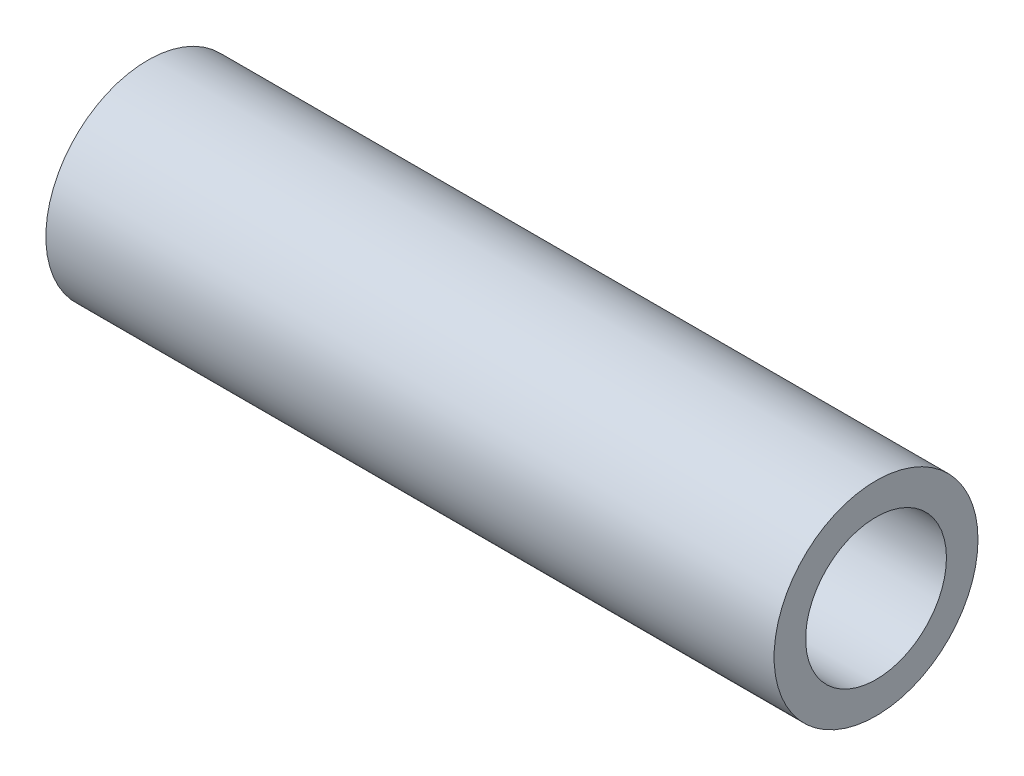
ISO-10303-21;
HEADER;
FILE_DESCRIPTION(('STEP AP214'),'2;1');
FILE_NAME('part.step','',(''),(''),'','','');
FILE_SCHEMA(('AUTOMOTIVE_DESIGN { 1 0 10303 214 1 1 1 1 }'));
ENDSEC;
DATA;
#1=APPLICATION_CONTEXT('core data for automotive mechanical design processes');
#2=APPLICATION_PROTOCOL_DEFINITION('international standard','automotive_design',2000,#1);
#3=PRODUCT_CONTEXT('',#1,'mechanical');
#4=PRODUCT('Part','Part','',(#3));
#5=PRODUCT_RELATED_PRODUCT_CATEGORY('part','',(#4));
#6=PRODUCT_DEFINITION_FORMATION('','',#4);
#7=PRODUCT_DEFINITION_CONTEXT('part definition',#1,'design');
#8=PRODUCT_DEFINITION('design','',#6,#7);
#9=PRODUCT_DEFINITION_SHAPE('','',#8);
#10=(LENGTH_UNIT() NAMED_UNIT(*) SI_UNIT(.MILLI.,.METRE.));
#11=(NAMED_UNIT(*) PLANE_ANGLE_UNIT() SI_UNIT($,.RADIAN.));
#12=(NAMED_UNIT(*) SI_UNIT($,.STERADIAN.) SOLID_ANGLE_UNIT());
#13=UNCERTAINTY_MEASURE_WITH_UNIT(LENGTH_MEASURE(1.E-05),#10,'distance_accuracy_value','');
#14=(GEOMETRIC_REPRESENTATION_CONTEXT(3) GLOBAL_UNCERTAINTY_ASSIGNED_CONTEXT((#13)) GLOBAL_UNIT_ASSIGNED_CONTEXT((#10,
#11,#12)) REPRESENTATION_CONTEXT('',''));
#15=CARTESIAN_POINT('',(0.,0.,0.));
#16=DIRECTION('',(0.,0.,1.));
#17=DIRECTION('',(1.,0.,0.));
#18=AXIS2_PLACEMENT_3D('',#15,#16,#17);
#19=CARTESIAN_POINT('',(-76.2,0.,0.));
#20=DIRECTION('',(1.,0.,0.));
#21=DIRECTION('',(0.,0.,-1.));
#22=AXIS2_PLACEMENT_3D('',#19,#20,#21);
#23=CYLINDRICAL_SURFACE('',#22,10.668);
#24=CARTESIAN_POINT('',(-76.2,0.,0.));
#25=DIRECTION('',(1.,0.,0.));
#26=DIRECTION('',(0.,0.,-1.));
#27=AXIS2_PLACEMENT_3D('',#24,#25,#26);
#28=CIRCLE('',#27,10.668);
#29=CARTESIAN_POINT('',(-76.2,0.,-10.668));
#30=VERTEX_POINT('',#29);
#31=EDGE_CURVE('E10',#30,#30,#28,.T.);
#32=ORIENTED_EDGE('',*,*,#31,.T.);
#33=EDGE_LOOP('',(#32));
#34=FACE_BOUND('',#33,.T.);
#35=CARTESIAN_POINT('',(0.,0.,0.));
#36=DIRECTION('',(1.,0.,0.));
#37=DIRECTION('',(0.,0.,-1.));
#38=AXIS2_PLACEMENT_3D('',#35,#36,#37);
#39=CIRCLE('',#38,10.668);
#40=CARTESIAN_POINT('',(0.,0.,-10.668));
#41=VERTEX_POINT('',#40);
#42=EDGE_CURVE('E33',#41,#41,#39,.T.);
#43=ORIENTED_EDGE('',*,*,#42,.F.);
#44=EDGE_LOOP('',(#43));
#45=FACE_BOUND('',#44,.T.);
#46=ADVANCED_FACE('F30',(#34,#45),#23,.T.);
#47=CARTESIAN_POINT('',(-76.2,0.,0.));
#48=DIRECTION('',(1.,0.,0.));
#49=DIRECTION('',(0.,0.,-1.));
#50=AXIS2_PLACEMENT_3D('',#47,#48,#49);
#51=PLANE('',#50);
#52=CARTESIAN_POINT('',(-76.2,0.,0.));
#53=DIRECTION('',(1.,0.,0.));
#54=DIRECTION('',(0.,0.,-1.));
#55=AXIS2_PLACEMENT_3D('',#52,#53,#54);
#56=CIRCLE('',#55,7.366);
#57=CARTESIAN_POINT('',(-76.2,0.,-7.366));
#58=VERTEX_POINT('',#57);
#59=EDGE_CURVE('E40',#58,#58,#56,.T.);
#60=ORIENTED_EDGE('',*,*,#59,.T.);
#61=EDGE_LOOP('',(#60));
#62=FACE_BOUND('',#61,.T.);
#63=ORIENTED_EDGE('',*,*,#31,.F.);
#64=EDGE_LOOP('',(#63));
#65=FACE_BOUND('',#64,.T.);
#66=ADVANCED_FACE('F48',(#62,#65),#51,.F.);
#67=CARTESIAN_POINT('',(0.,0.,0.));
#68=DIRECTION('',(1.,0.,0.));
#69=DIRECTION('',(0.,0.,-1.));
#70=AXIS2_PLACEMENT_3D('',#67,#68,#69);
#71=PLANE('',#70);
#72=CARTESIAN_POINT('',(0.,0.,0.));
#73=DIRECTION('',(1.,0.,0.));
#74=DIRECTION('',(0.,0.,-1.));
#75=AXIS2_PLACEMENT_3D('',#72,#73,#74);
#76=CIRCLE('',#75,7.366);
#77=CARTESIAN_POINT('',(0.,0.,-7.366));
#78=VERTEX_POINT('',#77);
#79=EDGE_CURVE('E42',#78,#78,#76,.T.);
#80=ORIENTED_EDGE('',*,*,#79,.F.);
#81=EDGE_LOOP('',(#80));
#82=FACE_BOUND('',#81,.T.);
#83=ORIENTED_EDGE('',*,*,#42,.T.);
#84=EDGE_LOOP('',(#83));
#85=FACE_BOUND('',#84,.T.);
#86=ADVANCED_FACE('F54',(#82,#85),#71,.T.);
#87=CARTESIAN_POINT('',(-76.2,0.,0.));
#88=DIRECTION('',(1.,0.,0.));
#89=DIRECTION('',(0.,0.,-1.));
#90=AXIS2_PLACEMENT_3D('',#87,#88,#89);
#91=CYLINDRICAL_SURFACE('',#90,7.366);
#92=ORIENTED_EDGE('',*,*,#59,.F.);
#93=EDGE_LOOP('',(#92));
#94=FACE_BOUND('',#93,.T.);
#95=ORIENTED_EDGE('',*,*,#79,.T.);
#96=EDGE_LOOP('',(#95));
#97=FACE_BOUND('',#96,.T.);
#98=ADVANCED_FACE('F51',(#94,#97),#91,.F.);
#99=CLOSED_SHELL('',(#46,#66,#86,#98));
#100=MANIFOLD_SOLID_BREP('B2',#99);
#101=ADVANCED_BREP_SHAPE_REPRESENTATION('',(#18,#100),#14);
#102=SHAPE_DEFINITION_REPRESENTATION(#9,#101);
ENDSEC;
END-ISO-10303-21;
